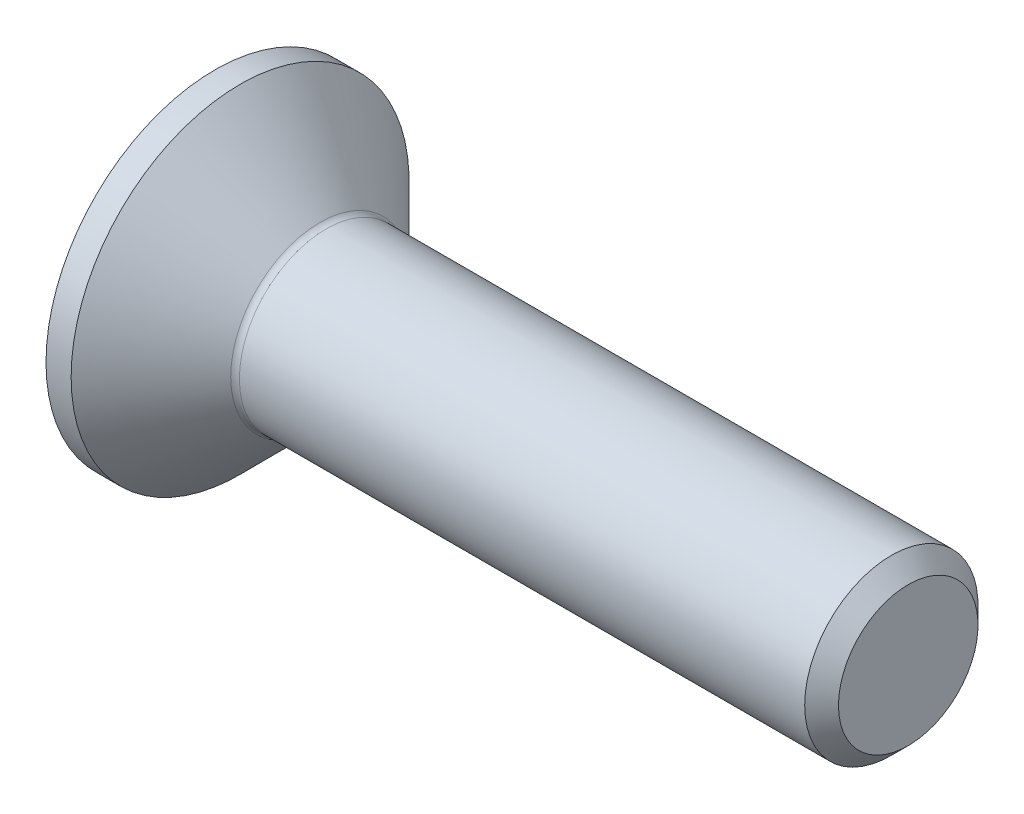
ISO-10303-21;
HEADER;
FILE_DESCRIPTION(('STEP AP214'),'2;1');
FILE_NAME('part.step','',(''),(''),'','','');
FILE_SCHEMA(('AUTOMOTIVE_DESIGN { 1 0 10303 214 1 1 1 1 }'));
ENDSEC;
DATA;
#1=APPLICATION_CONTEXT('core data for automotive mechanical design processes');
#2=APPLICATION_PROTOCOL_DEFINITION('international standard','automotive_design',2000,#1);
#3=PRODUCT_CONTEXT('',#1,'mechanical');
#4=PRODUCT('Part','Part','',(#3));
#5=PRODUCT_RELATED_PRODUCT_CATEGORY('part','',(#4));
#6=PRODUCT_DEFINITION_FORMATION('','',#4);
#7=PRODUCT_DEFINITION_CONTEXT('part definition',#1,'design');
#8=PRODUCT_DEFINITION('design','',#6,#7);
#9=PRODUCT_DEFINITION_SHAPE('','',#8);
#10=(LENGTH_UNIT() NAMED_UNIT(*) SI_UNIT(.MILLI.,.METRE.));
#11=(NAMED_UNIT(*) PLANE_ANGLE_UNIT() SI_UNIT($,.RADIAN.));
#12=(NAMED_UNIT(*) SI_UNIT($,.STERADIAN.) SOLID_ANGLE_UNIT());
#13=UNCERTAINTY_MEASURE_WITH_UNIT(LENGTH_MEASURE(1.E-05),#10,'distance_accuracy_value','');
#14=(GEOMETRIC_REPRESENTATION_CONTEXT(3) GLOBAL_UNCERTAINTY_ASSIGNED_CONTEXT((#13)) GLOBAL_UNIT_ASSIGNED_CONTEXT((#10,
#11,#12)) REPRESENTATION_CONTEXT('',''));
#15=CARTESIAN_POINT('',(0.,0.,0.));
#16=DIRECTION('',(0.,0.,1.));
#17=DIRECTION('',(1.,0.,0.));
#18=AXIS2_PLACEMENT_3D('',#15,#16,#17);
#19=CARTESIAN_POINT('',(0.,0.,0.));
#20=DIRECTION('',(-1.,0.,0.));
#21=DIRECTION('',(0.,0.,1.));
#22=AXIS2_PLACEMENT_3D('',#19,#20,#21);
#23=PLANE('',#22);
#24=CARTESIAN_POINT('',(0.,0.,0.));
#25=DIRECTION('',(-1.,0.,0.));
#26=DIRECTION('',(0.,0.,1.));
#27=AXIS2_PLACEMENT_3D('',#24,#25,#26);
#28=CIRCLE('',#27,3.9);
#29=CARTESIAN_POINT('',(0.,0.,3.9));
#30=VERTEX_POINT('',#29);
#31=EDGE_CURVE('E152',#30,#30,#28,.T.);
#32=ORIENTED_EDGE('',*,*,#31,.T.);
#33=EDGE_LOOP('',(#32));
#34=FACE_BOUND('',#33,.T.);
#35=DIRECTION('',(0.,-0.5,-0.866025403784439));
#36=VECTOR('',#35,1.);
#37=CARTESIAN_POINT('',(0.,-0.721687836487033,1.25));
#38=LINE('',#37,#36);
#39=CARTESIAN_POINT('',(0.,-0.721687836487033,1.25));
#40=VERTEX_POINT('',#39);
#41=CARTESIAN_POINT('',(0.,-1.44337567297406,0.));
#42=VERTEX_POINT('',#41);
#43=EDGE_CURVE('E118',#40,#42,#38,.T.);
#44=ORIENTED_EDGE('',*,*,#43,.T.);
#45=DIRECTION('',(0.,0.5,-0.866025403784439));
#46=VECTOR('',#45,1.);
#47=CARTESIAN_POINT('',(0.,-1.44337567297406,0.));
#48=LINE('',#47,#46);
#49=CARTESIAN_POINT('',(0.,-0.721687836487033,-1.25));
#50=VERTEX_POINT('',#49);
#51=EDGE_CURVE('E49',#42,#50,#48,.T.);
#52=ORIENTED_EDGE('',*,*,#51,.T.);
#53=DIRECTION('',(0.,1.,0.));
#54=VECTOR('',#53,1.);
#55=CARTESIAN_POINT('',(0.,-0.721687836487033,-1.25));
#56=LINE('',#55,#54);
#57=CARTESIAN_POINT('',(0.,0.721687836487032,-1.25));
#58=VERTEX_POINT('',#57);
#59=EDGE_CURVE('E129',#50,#58,#56,.T.);
#60=ORIENTED_EDGE('',*,*,#59,.T.);
#61=DIRECTION('',(0.,0.5,0.866025403784438));
#62=VECTOR('',#61,1.);
#63=CARTESIAN_POINT('',(0.,0.721687836487032,-1.25));
#64=LINE('',#63,#62);
#65=CARTESIAN_POINT('',(0.,1.44337567297406,0.));
#66=VERTEX_POINT('',#65);
#67=EDGE_CURVE('E253',#58,#66,#64,.T.);
#68=ORIENTED_EDGE('',*,*,#67,.T.);
#69=DIRECTION('',(0.,-0.5,0.866025403784438));
#70=VECTOR('',#69,1.);
#71=CARTESIAN_POINT('',(0.,1.44337567297406,0.));
#72=LINE('',#71,#70);
#73=CARTESIAN_POINT('',(0.,0.721687836487032,1.25));
#74=VERTEX_POINT('',#73);
#75=EDGE_CURVE('E256',#66,#74,#72,.T.);
#76=ORIENTED_EDGE('',*,*,#75,.T.);
#77=DIRECTION('',(0.,-1.,0.));
#78=VECTOR('',#77,1.);
#79=CARTESIAN_POINT('',(0.,0.721687836487032,1.25));
#80=LINE('',#79,#78);
#81=EDGE_CURVE('E259',#74,#40,#80,.T.);
#82=ORIENTED_EDGE('',*,*,#81,.T.);
#83=EDGE_LOOP('',(#44,#52,#60,#68,#76,#82));
#84=FACE_BOUND('',#83,.T.);
#85=ADVANCED_FACE('F34',(#34,#84),#23,.T.);
#86=CARTESIAN_POINT('',(0.,0.,0.));
#87=DIRECTION('',(-1.,0.,0.));
#88=DIRECTION('',(0.,0.,1.));
#89=AXIS2_PLACEMENT_3D('',#86,#87,#88);
#90=CYLINDRICAL_SURFACE('',#89,3.9);
#91=CARTESIAN_POINT('',(0.580000000000009,0.,0.));
#92=DIRECTION('',(-1.,0.,0.));
#93=DIRECTION('',(0.,0.,1.));
#94=AXIS2_PLACEMENT_3D('',#91,#92,#93);
#95=CIRCLE('',#94,3.9);
#96=CARTESIAN_POINT('',(0.580000000000009,0.,3.9));
#97=VERTEX_POINT('',#96);
#98=EDGE_CURVE('E149',#97,#97,#95,.T.);
#99=ORIENTED_EDGE('',*,*,#98,.T.);
#100=EDGE_LOOP('',(#99));
#101=FACE_BOUND('',#100,.T.);
#102=ORIENTED_EDGE('',*,*,#31,.F.);
#103=EDGE_LOOP('',(#102));
#104=FACE_BOUND('',#103,.T.);
#105=ADVANCED_FACE('F173',(#101,#104),#90,.T.);
#106=CARTESIAN_POINT('',(0.580000000000009,0.,0.));
#107=DIRECTION('',(-1.,0.,0.));
#108=DIRECTION('',(0.,0.,1.));
#109=AXIS2_PLACEMENT_3D('',#106,#107,#108);
#110=CONICAL_SURFACE('',#109,3.9,0.78539816339745);
#111=CARTESIAN_POINT('',(2.42142135623733,0.,0.));
#112=DIRECTION('',(-1.,0.,0.));
#113=DIRECTION('',(0.,0.,1.));
#114=AXIS2_PLACEMENT_3D('',#111,#112,#113);
#115=CIRCLE('',#114,2.05857864376268);
#116=CARTESIAN_POINT('',(2.42142135623733,0.,2.05857864376268));
#117=VERTEX_POINT('',#116);
#118=EDGE_CURVE('E42',#117,#117,#115,.T.);
#119=ORIENTED_EDGE('',*,*,#118,.T.);
#120=EDGE_LOOP('',(#119));
#121=FACE_BOUND('',#120,.T.);
#122=ORIENTED_EDGE('',*,*,#98,.F.);
#123=EDGE_LOOP('',(#122));
#124=FACE_BOUND('',#123,.T.);
#125=ADVANCED_FACE('F157',(#121,#124),#110,.T.);
#126=CARTESIAN_POINT('',(0.,0.,0.));
#127=DIRECTION('',(-1.,0.,0.));
#128=DIRECTION('',(0.,0.,1.));
#129=AXIS2_PLACEMENT_3D('',#126,#127,#128);
#130=CYLINDRICAL_SURFACE('',#129,1.99999999999999);
#131=CARTESIAN_POINT('',(2.56284271247464,0.,0.));
#132=DIRECTION('',(-1.,0.,0.));
#133=DIRECTION('',(0.,0.,1.));
#134=AXIS2_PLACEMENT_3D('',#131,#132,#133);
#135=CIRCLE('',#134,1.99999999999999);
#136=CARTESIAN_POINT('',(2.56284271247464,0.,1.99999999999999));
#137=VERTEX_POINT('',#136);
#138=EDGE_CURVE('E11',#137,#137,#135,.F.);
#139=ORIENTED_EDGE('',*,*,#138,.T.);
#140=EDGE_LOOP('',(#139));
#141=FACE_BOUND('',#140,.T.);
#142=CARTESIAN_POINT('',(15.61,0.,0.));
#143=DIRECTION('',(-1.,0.,0.));
#144=DIRECTION('',(0.,0.,1.));
#145=AXIS2_PLACEMENT_3D('',#142,#143,#144);
#146=CIRCLE('',#145,1.99999999999997);
#147=CARTESIAN_POINT('',(15.61,0.,1.99999999999997));
#148=VERTEX_POINT('',#147);
#149=EDGE_CURVE('E146',#148,#148,#146,.T.);
#150=ORIENTED_EDGE('',*,*,#149,.T.);
#151=EDGE_LOOP('',(#150));
#152=FACE_BOUND('',#151,.T.);
#153=ADVANCED_FACE('F184',(#141,#152),#130,.T.);
#154=CARTESIAN_POINT('',(16.,0.,0.));
#155=DIRECTION('',(-1.,0.,0.));
#156=DIRECTION('',(0.,0.,1.));
#157=AXIS2_PLACEMENT_3D('',#154,#155,#156);
#158=CONICAL_SURFACE('',#157,1.61,0.78539816339739);
#159=ORIENTED_EDGE('',*,*,#149,.F.);
#160=EDGE_LOOP('',(#159));
#161=FACE_BOUND('',#160,.T.);
#162=CARTESIAN_POINT('',(16.,0.,0.));
#163=DIRECTION('',(-1.,0.,0.));
#164=DIRECTION('',(0.,0.,1.));
#165=AXIS2_PLACEMENT_3D('',#162,#163,#164);
#166=CIRCLE('',#165,1.61);
#167=CARTESIAN_POINT('',(16.,0.,1.61));
#168=VERTEX_POINT('',#167);
#169=EDGE_CURVE('E142',#168,#168,#166,.T.);
#170=ORIENTED_EDGE('',*,*,#169,.T.);
#171=EDGE_LOOP('',(#170));
#172=FACE_BOUND('',#171,.T.);
#173=ADVANCED_FACE('F168',(#161,#172),#158,.T.);
#174=CARTESIAN_POINT('',(16.,1.61,0.));
#175=DIRECTION('',(1.,0.,0.));
#176=DIRECTION('',(0.,0.,-1.));
#177=AXIS2_PLACEMENT_3D('',#174,#175,#176);
#178=PLANE('',#177);
#179=ORIENTED_EDGE('',*,*,#169,.F.);
#180=EDGE_LOOP('',(#179));
#181=FACE_BOUND('',#180,.T.);
#182=ADVANCED_FACE('F161',(#181),#178,.T.);
#183=CARTESIAN_POINT('',(2.56284271247464,0.,0.));
#184=DIRECTION('',(-1.,0.,0.));
#185=DIRECTION('',(0.,0.,1.));
#186=AXIS2_PLACEMENT_3D('',#183,#184,#185);
#187=TOROIDAL_SURFACE('',#186,2.19999999999999,0.2);
#188=ORIENTED_EDGE('',*,*,#138,.F.);
#189=EDGE_LOOP('',(#188));
#190=FACE_BOUND('',#189,.T.);
#191=ORIENTED_EDGE('',*,*,#118,.F.);
#192=EDGE_LOOP('',(#191));
#193=FACE_BOUND('',#192,.T.);
#194=ADVANCED_FACE('F36',(#190,#193),#187,.F.);
#195=CARTESIAN_POINT('',(1.5,-1.44337567297406,0.));
#196=DIRECTION('',(0.,0.866025403784439,0.5));
#197=DIRECTION('',(0.,-0.5,0.866025403784439));
#198=AXIS2_PLACEMENT_3D('',#195,#196,#197);
#199=PLANE('',#198);
#200=ORIENTED_EDGE('',*,*,#51,.F.);
#201=DIRECTION('',(-1.,0.,0.));
#202=VECTOR('',#201,1.);
#203=CARTESIAN_POINT('',(1.5,-1.44337567297406,0.));
#204=LINE('',#203,#202);
#205=CARTESIAN_POINT('',(1.5,-1.44337567297406,0.));
#206=VERTEX_POINT('',#205);
#207=EDGE_CURVE('E250',#206,#42,#204,.T.);
#208=ORIENTED_EDGE('',*,*,#207,.F.);
#209=DIRECTION('',(0.,0.5,-0.866025403784439));
#210=VECTOR('',#209,1.);
#211=CARTESIAN_POINT('',(1.5,-1.44337567297406,0.));
#212=LINE('',#211,#210);
#213=CARTESIAN_POINT('',(1.5,-1.08253175473055,-0.625));
#214=VERTEX_POINT('',#213);
#215=EDGE_CURVE('E114',#206,#214,#212,.T.);
#216=ORIENTED_EDGE('',*,*,#215,.T.);
#217=CARTESIAN_POINT('',(1.5,-0.721687836487033,-1.25));
#218=VERTEX_POINT('',#217);
#219=EDGE_CURVE('E110',#214,#218,#212,.T.);
#220=ORIENTED_EDGE('',*,*,#219,.T.);
#221=DIRECTION('',(-1.,0.,0.));
#222=VECTOR('',#221,1.);
#223=CARTESIAN_POINT('',(1.5,-0.721687836487033,-1.25));
#224=LINE('',#223,#222);
#225=EDGE_CURVE('E112',#218,#50,#224,.T.);
#226=ORIENTED_EDGE('',*,*,#225,.T.);
#227=EDGE_LOOP('',(#200,#208,#216,#220,#226));
#228=FACE_BOUND('',#227,.T.);
#229=ADVANCED_FACE('F111',(#228),#199,.T.);
#230=CARTESIAN_POINT('',(1.5,-0.721687836487033,-1.25));
#231=DIRECTION('',(0.,0.,1.));
#232=DIRECTION('',(0.,-1.,0.));
#233=AXIS2_PLACEMENT_3D('',#230,#231,#232);
#234=PLANE('',#233);
#235=ORIENTED_EDGE('',*,*,#59,.F.);
#236=ORIENTED_EDGE('',*,*,#225,.F.);
#237=DIRECTION('',(0.,1.,0.));
#238=VECTOR('',#237,1.);
#239=CARTESIAN_POINT('',(1.5,-0.721687836487033,-1.25));
#240=LINE('',#239,#238);
#241=CARTESIAN_POINT('',(1.5,0.,-1.25));
#242=VERTEX_POINT('',#241);
#243=EDGE_CURVE('E57',#218,#242,#240,.T.);
#244=ORIENTED_EDGE('',*,*,#243,.T.);
#245=CARTESIAN_POINT('',(1.5,0.721687836487032,-1.25));
#246=VERTEX_POINT('',#245);
#247=EDGE_CURVE('E124',#242,#246,#240,.T.);
#248=ORIENTED_EDGE('',*,*,#247,.T.);
#249=DIRECTION('',(-1.,0.,0.));
#250=VECTOR('',#249,1.);
#251=CARTESIAN_POINT('',(1.5,0.721687836487032,-1.25));
#252=LINE('',#251,#250);
#253=EDGE_CURVE('E131',#246,#58,#252,.T.);
#254=ORIENTED_EDGE('',*,*,#253,.T.);
#255=EDGE_LOOP('',(#235,#236,#244,#248,#254));
#256=FACE_BOUND('',#255,.T.);
#257=ADVANCED_FACE('F126',(#256),#234,.T.);
#258=CARTESIAN_POINT('',(1.5,0.721687836487032,-1.25));
#259=DIRECTION('',(0.,-0.866025403784439,0.5));
#260=DIRECTION('',(0.,-0.5,-0.866025403784439));
#261=AXIS2_PLACEMENT_3D('',#258,#259,#260);
#262=PLANE('',#261);
#263=ORIENTED_EDGE('',*,*,#67,.F.);
#264=ORIENTED_EDGE('',*,*,#253,.F.);
#265=DIRECTION('',(0.,0.5,0.866025403784438));
#266=VECTOR('',#265,1.);
#267=CARTESIAN_POINT('',(1.5,0.721687836487032,-1.25));
#268=LINE('',#267,#266);
#269=CARTESIAN_POINT('',(1.5,1.08253175473055,-0.625));
#270=VERTEX_POINT('',#269);
#271=EDGE_CURVE('E231',#246,#270,#268,.T.);
#272=ORIENTED_EDGE('',*,*,#271,.T.);
#273=CARTESIAN_POINT('',(1.5,1.44337567297406,0.));
#274=VERTEX_POINT('',#273);
#275=EDGE_CURVE('E123',#270,#274,#268,.T.);
#276=ORIENTED_EDGE('',*,*,#275,.T.);
#277=DIRECTION('',(-1.,0.,0.));
#278=VECTOR('',#277,1.);
#279=CARTESIAN_POINT('',(1.5,1.44337567297406,0.));
#280=LINE('',#279,#278);
#281=EDGE_CURVE('E137',#274,#66,#280,.T.);
#282=ORIENTED_EDGE('',*,*,#281,.T.);
#283=EDGE_LOOP('',(#263,#264,#272,#276,#282));
#284=FACE_BOUND('',#283,.T.);
#285=ADVANCED_FACE('F198',(#284),#262,.T.);
#286=CARTESIAN_POINT('',(1.5,1.44337567297406,0.));
#287=DIRECTION('',(0.,-0.866025403784438,-0.5));
#288=DIRECTION('',(0.,0.5,-0.866025403784438));
#289=AXIS2_PLACEMENT_3D('',#286,#287,#288);
#290=PLANE('',#289);
#291=ORIENTED_EDGE('',*,*,#75,.F.);
#292=ORIENTED_EDGE('',*,*,#281,.F.);
#293=DIRECTION('',(0.,-0.5,0.866025403784438));
#294=VECTOR('',#293,1.);
#295=CARTESIAN_POINT('',(1.5,1.44337567297406,0.));
#296=LINE('',#295,#294);
#297=CARTESIAN_POINT('',(1.5,1.08253175473055,0.625000000000001));
#298=VERTEX_POINT('',#297);
#299=EDGE_CURVE('E238',#274,#298,#296,.T.);
#300=ORIENTED_EDGE('',*,*,#299,.T.);
#301=CARTESIAN_POINT('',(1.5,0.721687836487032,1.25));
#302=VERTEX_POINT('',#301);
#303=EDGE_CURVE('E236',#298,#302,#296,.T.);
#304=ORIENTED_EDGE('',*,*,#303,.T.);
#305=DIRECTION('',(-1.,0.,0.));
#306=VECTOR('',#305,1.);
#307=CARTESIAN_POINT('',(1.5,0.721687836487032,1.25));
#308=LINE('',#307,#306);
#309=EDGE_CURVE('E268',#302,#74,#308,.T.);
#310=ORIENTED_EDGE('',*,*,#309,.T.);
#311=EDGE_LOOP('',(#291,#292,#300,#304,#310));
#312=FACE_BOUND('',#311,.T.);
#313=ADVANCED_FACE('F201',(#312),#290,.T.);
#314=CARTESIAN_POINT('',(1.5,0.721687836487032,1.25));
#315=DIRECTION('',(0.,0.,-1.));
#316=DIRECTION('',(0.,1.,0.));
#317=AXIS2_PLACEMENT_3D('',#314,#315,#316);
#318=PLANE('',#317);
#319=ORIENTED_EDGE('',*,*,#81,.F.);
#320=ORIENTED_EDGE('',*,*,#309,.F.);
#321=DIRECTION('',(0.,-1.,0.));
#322=VECTOR('',#321,1.);
#323=CARTESIAN_POINT('',(1.5,0.721687836487032,1.25));
#324=LINE('',#323,#322);
#325=CARTESIAN_POINT('',(1.5,0.,1.25));
#326=VERTEX_POINT('',#325);
#327=EDGE_CURVE('E243',#302,#326,#324,.T.);
#328=ORIENTED_EDGE('',*,*,#327,.T.);
#329=CARTESIAN_POINT('',(1.5,-0.721687836487033,1.25));
#330=VERTEX_POINT('',#329);
#331=EDGE_CURVE('E242',#326,#330,#324,.T.);
#332=ORIENTED_EDGE('',*,*,#331,.T.);
#333=DIRECTION('',(-1.,0.,0.));
#334=VECTOR('',#333,1.);
#335=CARTESIAN_POINT('',(1.5,-0.721687836487033,1.25));
#336=LINE('',#335,#334);
#337=EDGE_CURVE('E265',#330,#40,#336,.T.);
#338=ORIENTED_EDGE('',*,*,#337,.T.);
#339=EDGE_LOOP('',(#319,#320,#328,#332,#338));
#340=FACE_BOUND('',#339,.T.);
#341=ADVANCED_FACE('F205',(#340),#318,.T.);
#342=CARTESIAN_POINT('',(1.5,-0.721687836487033,1.25));
#343=DIRECTION('',(0.,0.866025403784439,-0.5));
#344=DIRECTION('',(0.,0.5,0.866025403784439));
#345=AXIS2_PLACEMENT_3D('',#342,#343,#344);
#346=PLANE('',#345);
#347=ORIENTED_EDGE('',*,*,#43,.F.);
#348=ORIENTED_EDGE('',*,*,#337,.F.);
#349=DIRECTION('',(0.,-0.5,-0.866025403784439));
#350=VECTOR('',#349,1.);
#351=CARTESIAN_POINT('',(1.5,-0.721687836487033,1.25));
#352=LINE('',#351,#350);
#353=CARTESIAN_POINT('',(1.5,-1.08253175473055,0.625));
#354=VERTEX_POINT('',#353);
#355=EDGE_CURVE('E247',#330,#354,#352,.T.);
#356=ORIENTED_EDGE('',*,*,#355,.T.);
#357=EDGE_CURVE('E246',#354,#206,#352,.T.);
#358=ORIENTED_EDGE('',*,*,#357,.T.);
#359=ORIENTED_EDGE('',*,*,#207,.T.);
#360=EDGE_LOOP('',(#347,#348,#356,#358,#359));
#361=FACE_BOUND('',#360,.T.);
#362=ADVANCED_FACE('F209',(#361),#346,.T.);
#363=CARTESIAN_POINT('',(1.5,-0.721687836487033,-1.25));
#364=DIRECTION('',(1.,0.,0.));
#365=DIRECTION('',(0.,0.,-1.));
#366=AXIS2_PLACEMENT_3D('',#363,#364,#365);
#367=PLANE('',#366);
#368=ORIENTED_EDGE('',*,*,#243,.F.);
#369=ORIENTED_EDGE('',*,*,#219,.F.);
#370=CARTESIAN_POINT('',(1.5,0.,0.));
#371=DIRECTION('',(-1.,0.,0.));
#372=DIRECTION('',(0.,0.,1.));
#373=AXIS2_PLACEMENT_3D('',#370,#371,#372);
#374=CIRCLE('',#373,1.25);
#375=EDGE_CURVE('E121',#242,#214,#374,.T.);
#376=ORIENTED_EDGE('',*,*,#375,.F.);
#377=EDGE_LOOP('',(#368,#369,#376));
#378=FACE_BOUND('',#377,.T.);
#379=ADVANCED_FACE('F120',(#378),#367,.F.);
#380=ORIENTED_EDGE('',*,*,#215,.F.);
#381=ORIENTED_EDGE('',*,*,#357,.F.);
#382=EDGE_CURVE('E134',#214,#354,#374,.T.);
#383=ORIENTED_EDGE('',*,*,#382,.F.);
#384=EDGE_LOOP('',(#380,#381,#383));
#385=FACE_BOUND('',#384,.T.);
#386=ADVANCED_FACE('F215',(#385),#367,.F.);
#387=ORIENTED_EDGE('',*,*,#355,.F.);
#388=ORIENTED_EDGE('',*,*,#331,.F.);
#389=EDGE_CURVE('E130',#354,#326,#374,.T.);
#390=ORIENTED_EDGE('',*,*,#389,.F.);
#391=EDGE_LOOP('',(#387,#388,#390));
#392=FACE_BOUND('',#391,.T.);
#393=ADVANCED_FACE('F219',(#392),#367,.F.);
#394=ORIENTED_EDGE('',*,*,#327,.F.);
#395=ORIENTED_EDGE('',*,*,#303,.F.);
#396=EDGE_CURVE('E136',#326,#298,#374,.T.);
#397=ORIENTED_EDGE('',*,*,#396,.F.);
#398=EDGE_LOOP('',(#394,#395,#397));
#399=FACE_BOUND('',#398,.T.);
#400=ADVANCED_FACE('F227',(#399),#367,.F.);
#401=ORIENTED_EDGE('',*,*,#299,.F.);
#402=ORIENTED_EDGE('',*,*,#275,.F.);
#403=EDGE_CURVE('E143',#298,#270,#374,.T.);
#404=ORIENTED_EDGE('',*,*,#403,.F.);
#405=EDGE_LOOP('',(#401,#402,#404));
#406=FACE_BOUND('',#405,.T.);
#407=ADVANCED_FACE('F222',(#406),#367,.F.);
#408=ORIENTED_EDGE('',*,*,#271,.F.);
#409=ORIENTED_EDGE('',*,*,#247,.F.);
#410=EDGE_CURVE('E232',#270,#242,#374,.T.);
#411=ORIENTED_EDGE('',*,*,#410,.F.);
#412=EDGE_LOOP('',(#408,#409,#411));
#413=FACE_BOUND('',#412,.T.);
#414=ADVANCED_FACE('F193',(#413),#367,.F.);
#415=CARTESIAN_POINT('',(1.5,0.,0.));
#416=DIRECTION('',(-1.,0.,0.));
#417=DIRECTION('',(0.,0.,1.));
#418=AXIS2_PLACEMENT_3D('',#415,#416,#417);
#419=CONICAL_SURFACE('',#418,1.25,1.04719755119659);
#420=CARTESIAN_POINT('',(2.22168783648704,0.,0.));
#421=VERTEX_POINT('',#420);
#422=VERTEX_LOOP('',#421);
#423=FACE_BOUND('',#422,.T.);
#424=ORIENTED_EDGE('',*,*,#396,.T.);
#425=ORIENTED_EDGE('',*,*,#403,.T.);
#426=ORIENTED_EDGE('',*,*,#410,.T.);
#427=ORIENTED_EDGE('',*,*,#375,.T.);
#428=ORIENTED_EDGE('',*,*,#382,.T.);
#429=ORIENTED_EDGE('',*,*,#389,.T.);
#430=EDGE_LOOP('',(#424,#425,#426,#427,#428,#429));
#431=FACE_BOUND('',#430,.T.);
#432=ADVANCED_FACE('F191',(#423,#431),#419,.F.);
#433=CLOSED_SHELL('',(#85,#105,#125,#153,#173,#182,#194,#229,#257,#285,#313,#341,#362,#379,#386,
#393,#400,#407,#414,#432));
#434=MANIFOLD_SOLID_BREP('B2',#433);
#435=ADVANCED_BREP_SHAPE_REPRESENTATION('',(#18,#434),#14);
#436=SHAPE_DEFINITION_REPRESENTATION(#9,#435);
ENDSEC;
END-ISO-10303-21;
